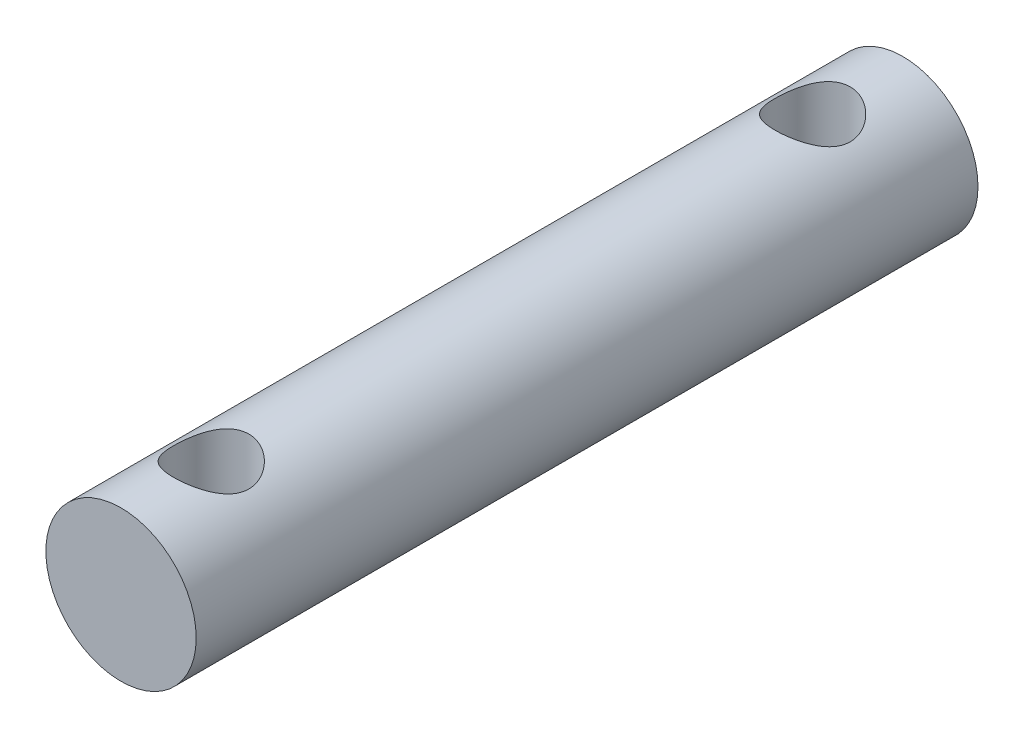
ISO-10303-21;
HEADER;
FILE_DESCRIPTION(('STEP AP214'),'2;1');
FILE_NAME('part.step','',(''),(''),'','','');
FILE_SCHEMA(('AUTOMOTIVE_DESIGN { 1 0 10303 214 1 1 1 1 }'));
ENDSEC;
DATA;
#1=APPLICATION_CONTEXT('core data for automotive mechanical design processes');
#2=APPLICATION_PROTOCOL_DEFINITION('international standard','automotive_design',2000,#1);
#3=PRODUCT_CONTEXT('',#1,'mechanical');
#4=PRODUCT('Part','Part','',(#3));
#5=PRODUCT_RELATED_PRODUCT_CATEGORY('part','',(#4));
#6=PRODUCT_DEFINITION_FORMATION('','',#4);
#7=PRODUCT_DEFINITION_CONTEXT('part definition',#1,'design');
#8=PRODUCT_DEFINITION('design','',#6,#7);
#9=PRODUCT_DEFINITION_SHAPE('','',#8);
#10=(LENGTH_UNIT() NAMED_UNIT(*) SI_UNIT(.MILLI.,.METRE.));
#11=(NAMED_UNIT(*) PLANE_ANGLE_UNIT() SI_UNIT($,.RADIAN.));
#12=(NAMED_UNIT(*) SI_UNIT($,.STERADIAN.) SOLID_ANGLE_UNIT());
#13=UNCERTAINTY_MEASURE_WITH_UNIT(LENGTH_MEASURE(1.E-05),#10,'distance_accuracy_value','');
#14=(GEOMETRIC_REPRESENTATION_CONTEXT(3) GLOBAL_UNCERTAINTY_ASSIGNED_CONTEXT((#13)) GLOBAL_UNIT_ASSIGNED_CONTEXT((#10,
#11,#12)) REPRESENTATION_CONTEXT('',''));
#15=CARTESIAN_POINT('',(0.,0.,0.));
#16=DIRECTION('',(0.,0.,1.));
#17=DIRECTION('',(1.,0.,0.));
#18=AXIS2_PLACEMENT_3D('',#15,#16,#17);
#19=CARTESIAN_POINT('',(0.772308089851625,0.,26.));
#20=DIRECTION('',(0.,0.,-1.));
#21=DIRECTION('',(-1.,0.,0.));
#22=AXIS2_PLACEMENT_3D('',#19,#20,#21);
#23=CYLINDRICAL_SURFACE('',#22,2.5);
#24=CARTESIAN_POINT('',(0.772308089851625,-2.5,4.25));
#25=CARTESIAN_POINT('',(0.838023043542859,-2.49999641755188,4.24999587210062));
#26=CARTESIAN_POINT('',(0.903816339474166,-2.49738113774397,4.24478740859791));
#27=CARTESIAN_POINT('',(1.03345838393716,-2.48717695046745,4.22418389957385));
#28=CARTESIAN_POINT('',(1.0973031982435,-2.47957859786229,4.20876950875294));
#29=CARTESIAN_POINT('',(1.22097502095234,-2.46020349254139,4.16850773922901));
#30=CARTESIAN_POINT('',(1.2808165935256,-2.448442989719,4.14369701968998));
#31=CARTESIAN_POINT('',(1.39539886085983,-2.42182220644723,4.08553672329382));
#32=CARTESIAN_POINT('',(1.45013995733919,-2.40696217041912,4.05218781968893));
#33=CARTESIAN_POINT('',(1.55669286205402,-2.37445322822571,3.97560343814338));
#34=CARTESIAN_POINT('',(1.60812710375427,-2.3566899890942,3.93189190095045));
#35=CARTESIAN_POINT('',(1.70328239593535,-2.3207496280843,3.83684815094121));
#36=CARTESIAN_POINT('',(1.74699756873508,-2.30257220261294,3.78551018528445));
#37=CARTESIAN_POINT('',(1.82887309041447,-2.26623688996684,3.67189581309577));
#38=CARTESIAN_POINT('',(1.86633975929117,-2.24818983712665,3.60907987706761));
#39=CARTESIAN_POINT('',(1.93001837346499,-2.21607473465401,3.47704083001723));
#40=CARTESIAN_POINT('',(1.95623835855954,-2.20200384508737,3.40782233909656));
#41=CARTESIAN_POINT('',(1.99497364258736,-2.1807233379726,3.2691686182226));
#42=CARTESIAN_POINT('',(2.00821541120218,-2.17315339479642,3.19999443491576));
#43=CARTESIAN_POINT('',(2.02284183148768,-2.16477362435659,3.06002645277565));
#44=CARTESIAN_POINT('',(2.02423820031797,-2.1639571167911,2.98923432391106));
#45=CARTESIAN_POINT('',(2.01566719881699,-2.1688866282156,2.85714246960579));
#46=CARTESIAN_POINT('',(2.00703878927265,-2.17385954577517,2.79571996097119));
#47=CARTESIAN_POINT('',(1.98098290117279,-2.18845285917313,2.6753476132837));
#48=CARTESIAN_POINT('',(1.96355261972369,-2.1980747353972,2.61639856836835));
#49=CARTESIAN_POINT('',(1.92007031533413,-2.22109345515926,2.50096358429292));
#50=CARTESIAN_POINT('',(1.89382692374662,-2.23457300829998,2.44456700151776));
#51=CARTESIAN_POINT('',(1.83361019943663,-2.26379255351754,2.33670713426249));
#52=CARTESIAN_POINT('',(1.79963339461721,-2.27953355975238,2.28524608049989));
#53=CARTESIAN_POINT('',(1.71989065849261,-2.31391447379107,2.18184843407097));
#54=CARTESIAN_POINT('',(1.67317616281323,-2.33266887795933,2.1306789080298));
#55=CARTESIAN_POINT('',(1.57175256327834,-2.36934529125509,2.03658072676137));
#56=CARTESIAN_POINT('',(1.51703966056948,-2.38726689948501,1.99365600995765));
#57=CARTESIAN_POINT('',(1.39795372214144,-2.42127484103705,1.91539292371284));
#58=CARTESIAN_POINT('',(1.33325007935089,-2.43723730202509,1.88049940944282));
#59=CARTESIAN_POINT('',(1.19789085921262,-2.46447351401553,1.82237871369624));
#60=CARTESIAN_POINT('',(1.12724006018322,-2.47575098679441,1.79914226873104));
#61=CARTESIAN_POINT('',(0.988266204427504,-2.49155417176795,1.76690574535415));
#62=CARTESIAN_POINT('',(0.920235003037032,-2.49656172876639,1.75688595531653));
#63=CARTESIAN_POINT('',(0.783282589788319,-2.50091266823877,1.74816908608189));
#64=CARTESIAN_POINT('',(0.71436181501425,-2.5002587340164,1.74946664295065));
#65=CARTESIAN_POINT('',(0.583266874869135,-2.49363990316801,1.76275836052344));
#66=CARTESIAN_POINT('',(0.520983829789184,-2.48809057110237,1.77391566591254));
#67=CARTESIAN_POINT('',(0.39929947447423,-2.47277714143524,1.80529758986886));
#68=CARTESIAN_POINT('',(0.33989848273788,-2.46301257917915,1.8255232080667));
#69=CARTESIAN_POINT('',(0.223697329289544,-2.43980314267087,1.87499808304146));
#70=CARTESIAN_POINT('',(0.167020093593934,-2.42626102212424,1.90448881264601));
#71=CARTESIAN_POINT('',(0.0592313877279745,-2.39679967896386,1.97138441955755));
#72=CARTESIAN_POINT('',(0.00812230263252321,-2.38087944457231,2.00879266824179));
#73=CARTESIAN_POINT('',(-0.092401521761691,-2.3463527667183,2.09470053166609));
#74=CARTESIAN_POINT('',(-0.141157007429173,-2.32763606060551,2.14392858556696));
#75=CARTESIAN_POINT('',(-0.230012311539924,-2.29077989504843,2.24990643908663));
#76=CARTESIAN_POINT('',(-0.270106142261926,-2.27264084226908,2.30666139852047));
#77=CARTESIAN_POINT('',(-0.342326803270494,-2.23813990282585,2.42955456775039));
#78=CARTESIAN_POINT('',(-0.373973779996671,-2.2219066207934,2.49601408276074));
#79=CARTESIAN_POINT('',(-0.425295442665628,-2.19467590460158,2.63438758461565));
#80=CARTESIAN_POINT('',(-0.444985555007837,-2.18367172800772,2.70629440812648));
#81=CARTESIAN_POINT('',(-0.470019019460473,-2.16951876260833,2.84613777857681));
#82=CARTESIAN_POINT('',(-0.476558155649456,-2.16571729325614,2.91379281678629));
#83=CARTESIAN_POINT('',(-0.478553353124358,-2.16456693307719,3.04930883396341));
#84=CARTESIAN_POINT('',(-0.474014218428873,-2.16721524534441,3.11716971092429));
#85=CARTESIAN_POINT('',(-0.455099567138704,-2.17797327562531,3.24435437691502));
#86=CARTESIAN_POINT('',(-0.441702303076875,-2.18553868102992,3.3038755876805));
#87=CARTESIAN_POINT('',(-0.406661107929182,-2.20463770234897,3.41976014928088));
#88=CARTESIAN_POINT('',(-0.385014524098138,-2.21617259462094,3.47612247761496));
#89=CARTESIAN_POINT('',(-0.332461591774229,-2.2428566295566,3.58828106373326));
#90=CARTESIAN_POINT('',(-0.301030832418948,-2.25819652995238,3.64378487728712));
#91=CARTESIAN_POINT('',(-0.230380624694168,-2.29044164543238,3.74909317022573));
#92=CARTESIAN_POINT('',(-0.191157124196686,-2.30734767243152,3.79889466314811));
#93=CARTESIAN_POINT('',(-0.100446068479177,-2.34327903949141,3.89767747794702));
#94=CARTESIAN_POINT('',(-0.0480474389110893,-2.36231229139336,3.9458238779524));
#95=CARTESIAN_POINT('',(0.0646145820762752,-2.39847190318859,4.03282872927954));
#96=CARTESIAN_POINT('',(0.124882185780643,-2.4155972326005,4.07168217428286));
#97=CARTESIAN_POINT('',(0.252393593826692,-2.44622511981379,4.13904545345275));
#98=CARTESIAN_POINT('',(0.319683709933357,-2.45970120703636,4.16748021176429));
#99=CARTESIAN_POINT('',(0.458880463233886,-2.48126676704332,4.21226020989869));
#100=CARTESIAN_POINT('',(0.530773340322668,-2.48937154216165,4.22863980853697));
#101=CARTESIAN_POINT('',(0.631555656747395,-2.49619327387079,4.24237176384481));
#102=CARTESIAN_POINT('',(0.659605740552251,-2.49761706674002,4.24522830107952));
#103=CARTESIAN_POINT('',(0.715868425092678,-2.49952121222331,4.24904333189601));
#104=CARTESIAN_POINT('',(0.744081030292398,-2.50000153879704,4.250001773089));
#105=CARTESIAN_POINT('',(0.772308089851625,-2.5,4.25));
#106=B_SPLINE_CURVE_WITH_KNOTS('',3,(#24,#25,#26,#27,#28,#29,#30,#31,#32,#33,#34,#35,#36,#37,
#38,#39,#40,#41,#42,#43,#44,#45,#46,#47,#48,#49,#50,#51,#52,#53,#54,#55,#56,#57,#58,#59,#60,#61,
#62,#63,#64,#65,#66,#67,#68,#69,#70,#71,#72,#73,#74,#75,#76,#77,#78,#79,#80,#81,#82,#83,#84,#85,
#86,#87,#88,#89,#90,#91,#92,#93,#94,#95,#96,#97,#98,#99,#100,#101,#102,#103,#104,#105),
.UNSPECIFIED.,.T.,.F.,(4,2,2,2,2,2,2,2,2,2,2,2,2,2,2,2,2,2,2,2,2,2,2,2,2,2,2,2,2,2,2,2,2,2,2,2,
2,2,2,2,4),(0.,0.197030321775366,0.394435187136497,0.591077694365373,0.787704700726959,
0.996227198397611,1.20490779706754,1.42977158038441,1.65447434872851,1.86572515175287,
2.07676696661276,2.26257140511651,2.44843504907098,2.63862800210609,2.82890651575277,
3.04331176667348,3.25781918248358,3.48228777768051,3.70657771140349,3.91229113089182,
4.11790705639345,4.30758633132652,4.49728652038664,4.69241070034873,4.88761813435424,
5.10199513305523,5.3165198576929,5.54143352699592,5.76605639925972,5.96911634372967,
6.17208824825007,6.35572412805228,6.53941910979597,6.73545570969518,6.93159451423697,
7.15156553440623,7.37165479220716,7.59330017078656,7.81431135781163,7.89894100172122,
7.98357298143558),.UNSPECIFIED.);
#107=CARTESIAN_POINT('',(0.772308089851625,-2.5,4.25));
#108=VERTEX_POINT('',#107);
#109=EDGE_CURVE('E10',#108,#108,#106,.T.);
#110=ORIENTED_EDGE('',*,*,#109,.T.);
#111=EDGE_LOOP('',(#110));
#112=FACE_BOUND('',#111,.T.);
#113=CARTESIAN_POINT('',(0.772308089851625,2.5,4.25));
#114=CARTESIAN_POINT('',(0.706593136160392,2.49999641755188,4.24999587210062));
#115=CARTESIAN_POINT('',(0.640799840229085,2.49738113774397,4.24478740859791));
#116=CARTESIAN_POINT('',(0.511157795766094,2.48717695046745,4.22418389957385));
#117=CARTESIAN_POINT('',(0.447312981459746,2.47957859786229,4.20876950875294));
#118=CARTESIAN_POINT('',(0.323641158750908,2.46020349254139,4.16850773922901));
#119=CARTESIAN_POINT('',(0.26379958617765,2.448442989719,4.14369701968998));
#120=CARTESIAN_POINT('',(0.149217318843419,2.42182220644723,4.08553672329382));
#121=CARTESIAN_POINT('',(0.0944762223640633,2.40696217041912,4.05218781968893));
#122=CARTESIAN_POINT('',(-0.012076682350773,2.37445322822571,3.97560343814338));
#123=CARTESIAN_POINT('',(-0.0635109240510138,2.3566899890942,3.93189190095045));
#124=CARTESIAN_POINT('',(-0.158666216232096,2.3207496280843,3.83684815094121));
#125=CARTESIAN_POINT('',(-0.202381389031832,2.30257220261294,3.78551018528445));
#126=CARTESIAN_POINT('',(-0.284256910711222,2.26623688996684,3.67189581309577));
#127=CARTESIAN_POINT('',(-0.321723579587921,2.24818983712665,3.60907987706761));
#128=CARTESIAN_POINT('',(-0.385402193761743,2.21607473465401,3.47704083001723));
#129=CARTESIAN_POINT('',(-0.411622178856292,2.20200384508737,3.40782233909656));
#130=CARTESIAN_POINT('',(-0.45035746288411,2.1807233379726,3.2691686182226));
#131=CARTESIAN_POINT('',(-0.463599231498926,2.17315339479642,3.19999443491576));
#132=CARTESIAN_POINT('',(-0.478225651784432,2.16477362435659,3.06002645277565));
#133=CARTESIAN_POINT('',(-0.479622020614717,2.1639571167911,2.98923432391106));
#134=CARTESIAN_POINT('',(-0.471051019113742,2.1688866282156,2.85714246960579));
#135=CARTESIAN_POINT('',(-0.462422609569402,2.17385954577517,2.79571996097119));
#136=CARTESIAN_POINT('',(-0.43636672146954,2.18845285917313,2.6753476132837));
#137=CARTESIAN_POINT('',(-0.418936440020439,2.1980747353972,2.61639856836835));
#138=CARTESIAN_POINT('',(-0.375454135630879,2.22109345515926,2.50096358429292));
#139=CARTESIAN_POINT('',(-0.349210744043368,2.23457300829998,2.44456700151776));
#140=CARTESIAN_POINT('',(-0.288994019733377,2.26379255351754,2.33670713426249));
#141=CARTESIAN_POINT('',(-0.255017214913959,2.27953355975238,2.28524608049989));
#142=CARTESIAN_POINT('',(-0.17527447878936,2.31391447379107,2.18184843407097));
#143=CARTESIAN_POINT('',(-0.128559983109976,2.33266887795933,2.1306789080298));
#144=CARTESIAN_POINT('',(-0.0271363835750912,2.36934529125509,2.03658072676137));
#145=CARTESIAN_POINT('',(0.0275765191337688,2.38726689948501,1.99365600995765));
#146=CARTESIAN_POINT('',(0.146662457561815,2.42127484103705,1.91539292371284));
#147=CARTESIAN_POINT('',(0.211366100352364,2.43723730202509,1.88049940944282));
#148=CARTESIAN_POINT('',(0.346725320490629,2.46447351401553,1.82237871369624));
#149=CARTESIAN_POINT('',(0.417376119520029,2.47575098679441,1.79914226873104));
#150=CARTESIAN_POINT('',(0.556349975275748,2.49155417176795,1.76690574535415));
#151=CARTESIAN_POINT('',(0.62438117666622,2.49656172876639,1.75688595531653));
#152=CARTESIAN_POINT('',(0.761333589914933,2.50091266823877,1.74816908608189));
#153=CARTESIAN_POINT('',(0.830254364689002,2.5002587340164,1.74946664295065));
#154=CARTESIAN_POINT('',(0.961349304834117,2.49363990316801,1.76275836052344));
#155=CARTESIAN_POINT('',(1.02363234991407,2.48809057110237,1.77391566591254));
#156=CARTESIAN_POINT('',(1.14531670522902,2.47277714143524,1.80529758986886));
#157=CARTESIAN_POINT('',(1.20471769696537,2.46301257917915,1.8255232080667));
#158=CARTESIAN_POINT('',(1.32091885041371,2.43980314267087,1.87499808304146));
#159=CARTESIAN_POINT('',(1.37759608610932,2.42626102212424,1.90448881264601));
#160=CARTESIAN_POINT('',(1.48538479197528,2.39679967896386,1.97138441955755));
#161=CARTESIAN_POINT('',(1.53649387707073,2.38087944457231,2.00879266824179));
#162=CARTESIAN_POINT('',(1.63701770146494,2.3463527667183,2.09470053166609));
#163=CARTESIAN_POINT('',(1.68577318713242,2.32763606060551,2.14392858556696));
#164=CARTESIAN_POINT('',(1.77462849124318,2.29077989504843,2.24990643908663));
#165=CARTESIAN_POINT('',(1.81472232196518,2.27264084226908,2.30666139852047));
#166=CARTESIAN_POINT('',(1.88694298297375,2.23813990282585,2.42955456775039));
#167=CARTESIAN_POINT('',(1.91858995969992,2.2219066207934,2.49601408276074));
#168=CARTESIAN_POINT('',(1.96991162236888,2.19467590460158,2.63438758461565));
#169=CARTESIAN_POINT('',(1.98960173471109,2.18367172800772,2.70629440812648));
#170=CARTESIAN_POINT('',(2.01463519916372,2.16951876260833,2.84613777857681));
#171=CARTESIAN_POINT('',(2.02117433535271,2.16571729325614,2.91379281678629));
#172=CARTESIAN_POINT('',(2.02316953282761,2.16456693307719,3.04930883396341));
#173=CARTESIAN_POINT('',(2.01863039813212,2.16721524534441,3.11716971092429));
#174=CARTESIAN_POINT('',(1.99971574684195,2.17797327562531,3.24435437691502));
#175=CARTESIAN_POINT('',(1.98631848278013,2.18553868102992,3.3038755876805));
#176=CARTESIAN_POINT('',(1.95127728763243,2.20463770234897,3.41976014928088));
#177=CARTESIAN_POINT('',(1.92963070380139,2.21617259462094,3.47612247761496));
#178=CARTESIAN_POINT('',(1.87707777147748,2.2428566295566,3.58828106373326));
#179=CARTESIAN_POINT('',(1.8456470121222,2.25819652995238,3.64378487728712));
#180=CARTESIAN_POINT('',(1.77499680439742,2.29044164543238,3.74909317022573));
#181=CARTESIAN_POINT('',(1.73577330389994,2.30734767243152,3.79889466314811));
#182=CARTESIAN_POINT('',(1.64506224818243,2.34327903949141,3.89767747794702));
#183=CARTESIAN_POINT('',(1.59266361861434,2.36231229139336,3.9458238779524));
#184=CARTESIAN_POINT('',(1.48000159762698,2.39847190318859,4.03282872927954));
#185=CARTESIAN_POINT('',(1.41973399392261,2.4155972326005,4.07168217428286));
#186=CARTESIAN_POINT('',(1.29222258587656,2.44622511981379,4.13904545345275));
#187=CARTESIAN_POINT('',(1.22493246976989,2.45970120703636,4.16748021176429));
#188=CARTESIAN_POINT('',(1.08573571646936,2.48126676704332,4.21226020989869));
#189=CARTESIAN_POINT('',(1.01384283938058,2.48937154216165,4.22863980853697));
#190=CARTESIAN_POINT('',(0.913060522955855,2.49619327387079,4.24237176384481));
#191=CARTESIAN_POINT('',(0.885010439150999,2.49761706674002,4.24522830107952));
#192=CARTESIAN_POINT('',(0.828747754610572,2.49952121222331,4.24904333189601));
#193=CARTESIAN_POINT('',(0.800535149410852,2.50000153879704,4.250001773089));
#194=CARTESIAN_POINT('',(0.772308089851625,2.5,4.25));
#195=B_SPLINE_CURVE_WITH_KNOTS('',3,(#113,#114,#115,#116,#117,#118,#119,#120,#121,#122,#123,
#124,#125,#126,#127,#128,#129,#130,#131,#132,#133,#134,#135,#136,#137,#138,#139,#140,#141,#142,
#143,#144,#145,#146,#147,#148,#149,#150,#151,#152,#153,#154,#155,#156,#157,#158,#159,#160,#161,
#162,#163,#164,#165,#166,#167,#168,#169,#170,#171,#172,#173,#174,#175,#176,#177,#178,#179,#180,
#181,#182,#183,#184,#185,#186,#187,#188,#189,#190,#191,#192,#193,#194),.UNSPECIFIED.,.T.,.F.,(4,
2,2,2,2,2,2,2,2,2,2,2,2,2,2,2,2,2,2,2,2,2,2,2,2,2,2,2,2,2,2,2,2,2,2,2,2,2,2,2,4),(0.,
0.197030321775366,0.394435187136497,0.591077694365373,0.787704700726959,0.996227198397611,
1.20490779706754,1.42977158038441,1.65447434872851,1.86572515175287,2.07676696661276,
2.26257140511651,2.44843504907098,2.63862800210609,2.82890651575277,3.04331176667348,
3.25781918248358,3.48228777768051,3.70657771140349,3.91229113089182,4.11790705639345,
4.30758633132652,4.49728652038664,4.69241070034873,4.88761813435424,5.10199513305524,
5.3165198576929,5.54143352699593,5.76605639925972,5.96911634372967,6.17208824825007,
6.35572412805228,6.53941910979598,6.73545570969518,6.93159451423697,7.15156553440623,
7.37165479220716,7.59330017078656,7.81431135781163,7.89894100172122,7.98357298143559),.UNSPECIFIED.);
#196=CARTESIAN_POINT('',(0.772308089851625,2.5,4.25));
#197=VERTEX_POINT('',#196);
#198=EDGE_CURVE('E55',#197,#197,#195,.T.);
#199=ORIENTED_EDGE('',*,*,#198,.T.);
#200=EDGE_LOOP('',(#199));
#201=FACE_BOUND('',#200,.T.);
#202=CARTESIAN_POINT('',(0.772308089851625,-2.5,24.25));
#203=CARTESIAN_POINT('',(0.838023043542859,-2.49999641755188,24.2499958721006));
#204=CARTESIAN_POINT('',(0.903816339474166,-2.49738113774397,24.2447874085979));
#205=CARTESIAN_POINT('',(1.03345838393716,-2.48717695046745,24.2241838995739));
#206=CARTESIAN_POINT('',(1.0973031982435,-2.47957859786229,24.2087695087529));
#207=CARTESIAN_POINT('',(1.22097502095234,-2.46020349254139,24.168507739229));
#208=CARTESIAN_POINT('',(1.2808165935256,-2.448442989719,24.14369701969));
#209=CARTESIAN_POINT('',(1.39539886085983,-2.42182220644723,24.0855367232938));
#210=CARTESIAN_POINT('',(1.45013995733919,-2.40696217041912,24.0521878196889));
#211=CARTESIAN_POINT('',(1.55669286205402,-2.37445322822571,23.9756034381434));
#212=CARTESIAN_POINT('',(1.60812710375427,-2.3566899890942,23.9318919009504));
#213=CARTESIAN_POINT('',(1.70328239593535,-2.3207496280843,23.8368481509412));
#214=CARTESIAN_POINT('',(1.74699756873508,-2.30257220261294,23.7855101852845));
#215=CARTESIAN_POINT('',(1.82887309041447,-2.26623688996684,23.6718958130958));
#216=CARTESIAN_POINT('',(1.86633975929117,-2.24818983712665,23.6090798770676));
#217=CARTESIAN_POINT('',(1.93001837346499,-2.21607473465401,23.4770408300172));
#218=CARTESIAN_POINT('',(1.95623835855954,-2.20200384508737,23.4078223390966));
#219=CARTESIAN_POINT('',(1.99497364258736,-2.1807233379726,23.2691686182226));
#220=CARTESIAN_POINT('',(2.00821541120218,-2.17315339479642,23.1999944349158));
#221=CARTESIAN_POINT('',(2.02284183148768,-2.16477362435659,23.0600264527757));
#222=CARTESIAN_POINT('',(2.02423820031797,-2.1639571167911,22.9892343239111));
#223=CARTESIAN_POINT('',(2.01566719881699,-2.1688866282156,22.8571424696058));
#224=CARTESIAN_POINT('',(2.00703878927265,-2.17385954577517,22.7957199609712));
#225=CARTESIAN_POINT('',(1.98098290117279,-2.18845285917313,22.6753476132837));
#226=CARTESIAN_POINT('',(1.96355261972369,-2.1980747353972,22.6163985683684));
#227=CARTESIAN_POINT('',(1.92007031533413,-2.22109345515926,22.5009635842929));
#228=CARTESIAN_POINT('',(1.89382692374662,-2.23457300829998,22.4445670015178));
#229=CARTESIAN_POINT('',(1.83361019943663,-2.26379255351754,22.3367071342625));
#230=CARTESIAN_POINT('',(1.79963339461721,-2.27953355975238,22.2852460804999));
#231=CARTESIAN_POINT('',(1.71989065849261,-2.31391447379107,22.181848434071));
#232=CARTESIAN_POINT('',(1.67317616281323,-2.33266887795933,22.1306789080298));
#233=CARTESIAN_POINT('',(1.57175256327834,-2.36934529125509,22.0365807267614));
#234=CARTESIAN_POINT('',(1.51703966056948,-2.38726689948501,21.9936560099576));
#235=CARTESIAN_POINT('',(1.39795372214143,-2.42127484103705,21.9153929237128));
#236=CARTESIAN_POINT('',(1.33325007935088,-2.43723730202509,21.8804994094428));
#237=CARTESIAN_POINT('',(1.19789085921262,-2.46447351401553,21.8223787136962));
#238=CARTESIAN_POINT('',(1.12724006018322,-2.47575098679441,21.799142268731));
#239=CARTESIAN_POINT('',(0.988266204427501,-2.49155417176795,21.7669057453542));
#240=CARTESIAN_POINT('',(0.920235003037029,-2.49656172876639,21.7568859553165));
#241=CARTESIAN_POINT('',(0.783282589788316,-2.50091266823877,21.7481690860819));
#242=CARTESIAN_POINT('',(0.714361815014248,-2.5002587340164,21.7494666429507));
#243=CARTESIAN_POINT('',(0.583266874869132,-2.49363990316801,21.7627583605234));
#244=CARTESIAN_POINT('',(0.520983829789182,-2.48809057110237,21.7739156659125));
#245=CARTESIAN_POINT('',(0.399299474474229,-2.47277714143523,21.8052975898689));
#246=CARTESIAN_POINT('',(0.339898482737879,-2.46301257917915,21.8255232080667));
#247=CARTESIAN_POINT('',(0.223697329289544,-2.43980314267087,21.8749980830415));
#248=CARTESIAN_POINT('',(0.167020093593933,-2.42626102212424,21.904488812646));
#249=CARTESIAN_POINT('',(0.0592313877279741,-2.39679967896386,21.9713844195576));
#250=CARTESIAN_POINT('',(0.00812230263252249,-2.38087944457231,22.0087926682418));
#251=CARTESIAN_POINT('',(-0.0924015217616913,-2.3463527667183,22.0947005316661));
#252=CARTESIAN_POINT('',(-0.141157007429173,-2.32763606060551,22.143928585567));
#253=CARTESIAN_POINT('',(-0.230012311539924,-2.29077989504843,22.2499064390866));
#254=CARTESIAN_POINT('',(-0.270106142261926,-2.27264084226908,22.3066613985205));
#255=CARTESIAN_POINT('',(-0.342326803270495,-2.23813990282585,22.4295545677504));
#256=CARTESIAN_POINT('',(-0.373973779996672,-2.2219066207934,22.4960140827607));
#257=CARTESIAN_POINT('',(-0.425295442665629,-2.19467590460158,22.6343875846157));
#258=CARTESIAN_POINT('',(-0.444985555007838,-2.18367172800772,22.7062944081265));
#259=CARTESIAN_POINT('',(-0.470019019460474,-2.16951876260833,22.8461377785768));
#260=CARTESIAN_POINT('',(-0.476558155649456,-2.16571729325614,22.9137928167863));
#261=CARTESIAN_POINT('',(-0.478553353124359,-2.16456693307719,23.0493088339634));
#262=CARTESIAN_POINT('',(-0.474014218428873,-2.16721524534441,23.1171697109243));
#263=CARTESIAN_POINT('',(-0.455099567138703,-2.17797327562531,23.244354376915));
#264=CARTESIAN_POINT('',(-0.441702303076874,-2.18553868102992,23.3038755876805));
#265=CARTESIAN_POINT('',(-0.40666110792918,-2.20463770234897,23.4197601492809));
#266=CARTESIAN_POINT('',(-0.385014524098137,-2.21617259462094,23.476122477615));
#267=CARTESIAN_POINT('',(-0.332461591774228,-2.2428566295566,23.5882810637333));
#268=CARTESIAN_POINT('',(-0.301030832418947,-2.25819652995238,23.6437848772871));
#269=CARTESIAN_POINT('',(-0.230380624694168,-2.29044164543238,23.7490931702257));
#270=CARTESIAN_POINT('',(-0.191157124196685,-2.30734767243152,23.7988946631481));
#271=CARTESIAN_POINT('',(-0.100446068479175,-2.34327903949141,23.897677477947));
#272=CARTESIAN_POINT('',(-0.0480474389110873,-2.36231229139336,23.9458238779524));
#273=CARTESIAN_POINT('',(0.064614582076278,-2.3984719031886,24.0328287292795));
#274=CARTESIAN_POINT('',(0.124882185780647,-2.4155972326005,24.0716821742829));
#275=CARTESIAN_POINT('',(0.252393593826695,-2.44622511981379,24.1390454534528));
#276=CARTESIAN_POINT('',(0.31968370993336,-2.45970120703636,24.1674802117643));
#277=CARTESIAN_POINT('',(0.458880463233888,-2.48126676704332,24.2122602098987));
#278=CARTESIAN_POINT('',(0.530773340322669,-2.48937154216165,24.228639808537));
#279=CARTESIAN_POINT('',(0.631555656747396,-2.49619327387079,24.2423717638448));
#280=CARTESIAN_POINT('',(0.659605740552253,-2.49761706674002,24.2452283010795));
#281=CARTESIAN_POINT('',(0.715868425092679,-2.49952121222331,24.249043331896));
#282=CARTESIAN_POINT('',(0.744081030292399,-2.50000153879704,24.250001773089));
#283=CARTESIAN_POINT('',(0.772308089851625,-2.5,24.25));
#284=B_SPLINE_CURVE_WITH_KNOTS('',3,(#202,#203,#204,#205,#206,#207,#208,#209,#210,#211,#212,
#213,#214,#215,#216,#217,#218,#219,#220,#221,#222,#223,#224,#225,#226,#227,#228,#229,#230,#231,
#232,#233,#234,#235,#236,#237,#238,#239,#240,#241,#242,#243,#244,#245,#246,#247,#248,#249,#250,
#251,#252,#253,#254,#255,#256,#257,#258,#259,#260,#261,#262,#263,#264,#265,#266,#267,#268,#269,
#270,#271,#272,#273,#274,#275,#276,#277,#278,#279,#280,#281,#282,#283),.UNSPECIFIED.,.T.,.F.,(4,
2,2,2,2,2,2,2,2,2,2,2,2,2,2,2,2,2,2,2,2,2,2,2,2,2,2,2,2,2,2,2,2,2,2,2,2,2,2,2,4),(0.,
0.197030321775366,0.394435187136498,0.591077694365373,0.78770470072696,0.99622719839761,
1.20490779706754,1.42977158038441,1.65447434872851,1.86572515175287,2.07676696661276,
2.26257140511651,2.44843504907099,2.63862800210609,2.82890651575277,3.04331176667348,
3.25781918248358,3.48228777768051,3.7065777114035,3.91229113089182,4.11790705639345,
4.30758633132653,4.49728652038665,4.69241070034873,4.88761813435424,5.10199513305524,
5.3165198576929,5.54143352699593,5.76605639925973,5.96911634372967,6.17208824825007,
6.35572412805229,6.53941910979598,6.73545570969518,6.93159451423697,7.15156553440623,
7.37165479220716,7.59330017078657,7.81431135781163,7.89894100172122,7.98357298143559),.UNSPECIFIED.);
#285=CARTESIAN_POINT('',(0.772308089851625,-2.5,24.25));
#286=VERTEX_POINT('',#285);
#287=EDGE_CURVE('E60',#286,#286,#284,.T.);
#288=ORIENTED_EDGE('',*,*,#287,.T.);
#289=EDGE_LOOP('',(#288));
#290=FACE_BOUND('',#289,.T.);
#291=CARTESIAN_POINT('',(0.772308089851625,2.5,24.25));
#292=CARTESIAN_POINT('',(0.706593136160392,2.49999641755188,24.2499958721006));
#293=CARTESIAN_POINT('',(0.640799840229085,2.49738113774397,24.2447874085979));
#294=CARTESIAN_POINT('',(0.511157795766094,2.48717695046745,24.2241838995739));
#295=CARTESIAN_POINT('',(0.447312981459746,2.47957859786229,24.2087695087529));
#296=CARTESIAN_POINT('',(0.323641158750907,2.46020349254139,24.168507739229));
#297=CARTESIAN_POINT('',(0.26379958617765,2.448442989719,24.14369701969));
#298=CARTESIAN_POINT('',(0.149217318843419,2.42182220644723,24.0855367232938));
#299=CARTESIAN_POINT('',(0.0944762223640631,2.40696217041912,24.0521878196889));
#300=CARTESIAN_POINT('',(-0.0120766823507736,2.37445322822571,23.9756034381434));
#301=CARTESIAN_POINT('',(-0.0635109240510152,2.3566899890942,23.9318919009504));
#302=CARTESIAN_POINT('',(-0.158666216232097,2.3207496280843,23.8368481509412));
#303=CARTESIAN_POINT('',(-0.202381389031833,2.30257220261294,23.7855101852845));
#304=CARTESIAN_POINT('',(-0.284256910711222,2.26623688996684,23.6718958130958));
#305=CARTESIAN_POINT('',(-0.321723579587921,2.24818983712665,23.6090798770676));
#306=CARTESIAN_POINT('',(-0.385402193761744,2.21607473465401,23.4770408300172));
#307=CARTESIAN_POINT('',(-0.411622178856292,2.20200384508737,23.4078223390966));
#308=CARTESIAN_POINT('',(-0.450357462884111,2.1807233379726,23.2691686182226));
#309=CARTESIAN_POINT('',(-0.463599231498927,2.17315339479642,23.1999944349158));
#310=CARTESIAN_POINT('',(-0.478225651784433,2.16477362435659,23.0600264527757));
#311=CARTESIAN_POINT('',(-0.479622020614718,2.1639571167911,22.9892343239111));
#312=CARTESIAN_POINT('',(-0.471051019113743,2.1688866282156,22.8571424696058));
#313=CARTESIAN_POINT('',(-0.462422609569402,2.17385954577517,22.7957199609712));
#314=CARTESIAN_POINT('',(-0.43636672146954,2.18845285917313,22.6753476132837));
#315=CARTESIAN_POINT('',(-0.418936440020439,2.1980747353972,22.6163985683684));
#316=CARTESIAN_POINT('',(-0.375454135630879,2.22109345515926,22.5009635842929));
#317=CARTESIAN_POINT('',(-0.349210744043367,2.23457300829998,22.4445670015178));
#318=CARTESIAN_POINT('',(-0.288994019733377,2.26379255351754,22.3367071342625));
#319=CARTESIAN_POINT('',(-0.255017214913959,2.27953355975238,22.2852460804999));
#320=CARTESIAN_POINT('',(-0.17527447878936,2.31391447379107,22.181848434071));
#321=CARTESIAN_POINT('',(-0.128559983109976,2.33266887795933,22.1306789080298));
#322=CARTESIAN_POINT('',(-0.0271363835750909,2.36934529125509,22.0365807267614));
#323=CARTESIAN_POINT('',(0.0275765191337697,2.38726689948501,21.9936560099576));
#324=CARTESIAN_POINT('',(0.146662457561817,2.42127484103705,21.9153929237128));
#325=CARTESIAN_POINT('',(0.211366100352366,2.43723730202509,21.8804994094428));
#326=CARTESIAN_POINT('',(0.346725320490631,2.46447351401553,21.8223787136962));
#327=CARTESIAN_POINT('',(0.417376119520032,2.47575098679441,21.799142268731));
#328=CARTESIAN_POINT('',(0.55634997527575,2.49155417176795,21.7669057453542));
#329=CARTESIAN_POINT('',(0.624381176666222,2.49656172876639,21.7568859553165));
#330=CARTESIAN_POINT('',(0.761333589914935,2.50091266823877,21.7481690860819));
#331=CARTESIAN_POINT('',(0.830254364689003,2.5002587340164,21.7494666429507));
#332=CARTESIAN_POINT('',(0.961349304834119,2.49363990316801,21.7627583605234));
#333=CARTESIAN_POINT('',(1.02363234991407,2.48809057110237,21.7739156659125));
#334=CARTESIAN_POINT('',(1.14531670522902,2.47277714143523,21.8052975898689));
#335=CARTESIAN_POINT('',(1.20471769696537,2.46301257917915,21.8255232080667));
#336=CARTESIAN_POINT('',(1.32091885041371,2.43980314267087,21.8749980830415));
#337=CARTESIAN_POINT('',(1.37759608610932,2.42626102212424,21.904488812646));
#338=CARTESIAN_POINT('',(1.48538479197528,2.39679967896386,21.9713844195576));
#339=CARTESIAN_POINT('',(1.53649387707073,2.38087944457231,22.0087926682418));
#340=CARTESIAN_POINT('',(1.63701770146494,2.3463527667183,22.0947005316661));
#341=CARTESIAN_POINT('',(1.68577318713242,2.32763606060551,22.143928585567));
#342=CARTESIAN_POINT('',(1.77462849124318,2.29077989504843,22.2499064390866));
#343=CARTESIAN_POINT('',(1.81472232196518,2.27264084226908,22.3066613985205));
#344=CARTESIAN_POINT('',(1.88694298297375,2.23813990282585,22.4295545677504));
#345=CARTESIAN_POINT('',(1.91858995969992,2.2219066207934,22.4960140827607));
#346=CARTESIAN_POINT('',(1.96991162236888,2.19467590460158,22.6343875846157));
#347=CARTESIAN_POINT('',(1.98960173471109,2.18367172800772,22.7062944081265));
#348=CARTESIAN_POINT('',(2.01463519916372,2.16951876260833,22.8461377785768));
#349=CARTESIAN_POINT('',(2.02117433535271,2.16571729325614,22.9137928167863));
#350=CARTESIAN_POINT('',(2.02316953282761,2.16456693307719,23.0493088339634));
#351=CARTESIAN_POINT('',(2.01863039813212,2.16721524534441,23.1171697109243));
#352=CARTESIAN_POINT('',(1.99971574684195,2.17797327562531,23.244354376915));
#353=CARTESIAN_POINT('',(1.98631848278012,2.18553868102992,23.3038755876805));
#354=CARTESIAN_POINT('',(1.95127728763243,2.20463770234897,23.4197601492809));
#355=CARTESIAN_POINT('',(1.92963070380139,2.21617259462094,23.476122477615));
#356=CARTESIAN_POINT('',(1.87707777147748,2.2428566295566,23.5882810637333));
#357=CARTESIAN_POINT('',(1.8456470121222,2.25819652995238,23.6437848772871));
#358=CARTESIAN_POINT('',(1.77499680439742,2.29044164543238,23.7490931702257));
#359=CARTESIAN_POINT('',(1.73577330389994,2.30734767243152,23.7988946631481));
#360=CARTESIAN_POINT('',(1.64506224818243,2.34327903949141,23.897677477947));
#361=CARTESIAN_POINT('',(1.59266361861434,2.36231229139336,23.9458238779524));
#362=CARTESIAN_POINT('',(1.48000159762697,2.3984719031886,24.0328287292795));
#363=CARTESIAN_POINT('',(1.4197339939226,2.4155972326005,24.0716821742829));
#364=CARTESIAN_POINT('',(1.29222258587656,2.44622511981379,24.1390454534528));
#365=CARTESIAN_POINT('',(1.22493246976989,2.45970120703636,24.1674802117643));
#366=CARTESIAN_POINT('',(1.08573571646936,2.48126676704332,24.2122602098987));
#367=CARTESIAN_POINT('',(1.01384283938058,2.48937154216165,24.228639808537));
#368=CARTESIAN_POINT('',(0.913060522955855,2.49619327387079,24.2423717638448));
#369=CARTESIAN_POINT('',(0.885010439150998,2.49761706674002,24.2452283010795));
#370=CARTESIAN_POINT('',(0.828747754610572,2.49952121222331,24.249043331896));
#371=CARTESIAN_POINT('',(0.800535149410852,2.50000153879704,24.250001773089));
#372=CARTESIAN_POINT('',(0.772308089851625,2.5,24.25));
#373=B_SPLINE_CURVE_WITH_KNOTS('',3,(#291,#292,#293,#294,#295,#296,#297,#298,#299,#300,#301,
#302,#303,#304,#305,#306,#307,#308,#309,#310,#311,#312,#313,#314,#315,#316,#317,#318,#319,#320,
#321,#322,#323,#324,#325,#326,#327,#328,#329,#330,#331,#332,#333,#334,#335,#336,#337,#338,#339,
#340,#341,#342,#343,#344,#345,#346,#347,#348,#349,#350,#351,#352,#353,#354,#355,#356,#357,#358,
#359,#360,#361,#362,#363,#364,#365,#366,#367,#368,#369,#370,#371,#372),.UNSPECIFIED.,.T.,.F.,(4,
2,2,2,2,2,2,2,2,2,2,2,2,2,2,2,2,2,2,2,2,2,2,2,2,2,2,2,2,2,2,2,2,2,2,2,2,2,2,2,4),(0.,
0.197030321775366,0.394435187136497,0.591077694365373,0.78770470072696,0.996227198397611,
1.20490779706754,1.42977158038441,1.65447434872851,1.86572515175287,2.07676696661276,
2.26257140511651,2.44843504907099,2.63862800210609,2.82890651575277,3.04331176667348,
3.25781918248358,3.48228777768051,3.7065777114035,3.91229113089182,4.11790705639345,
4.30758633132653,4.49728652038664,4.69241070034873,4.88761813435424,5.10199513305523,
5.3165198576929,5.54143352699593,5.76605639925973,5.96911634372967,6.17208824825007,
6.35572412805229,6.53941910979598,6.73545570969518,6.93159451423698,7.15156553440623,
7.37165479220717,7.59330017078657,7.81431135781163,7.89894100172122,7.98357298143559),.UNSPECIFIED.);
#374=CARTESIAN_POINT('',(0.772308089851625,2.5,24.25));
#375=VERTEX_POINT('',#374);
#376=EDGE_CURVE('E65',#375,#375,#373,.T.);
#377=ORIENTED_EDGE('',*,*,#376,.T.);
#378=EDGE_LOOP('',(#377));
#379=FACE_BOUND('',#378,.T.);
#380=CARTESIAN_POINT('',(0.772308089851625,0.,26.));
#381=DIRECTION('',(0.,0.,1.));
#382=DIRECTION('',(1.,0.,0.));
#383=AXIS2_PLACEMENT_3D('',#380,#381,#382);
#384=CIRCLE('',#383,2.5);
#385=CARTESIAN_POINT('',(3.27230808985162,0.,26.));
#386=VERTEX_POINT('',#385);
#387=EDGE_CURVE('E94',#386,#386,#384,.T.);
#388=ORIENTED_EDGE('',*,*,#387,.F.);
#389=EDGE_LOOP('',(#388));
#390=FACE_BOUND('',#389,.T.);
#391=CARTESIAN_POINT('',(0.772308089851625,0.,0.));
#392=DIRECTION('',(0.,0.,1.));
#393=DIRECTION('',(1.,0.,0.));
#394=AXIS2_PLACEMENT_3D('',#391,#392,#393);
#395=CIRCLE('',#394,2.5);
#396=CARTESIAN_POINT('',(3.27230808985162,0.,0.));
#397=VERTEX_POINT('',#396);
#398=EDGE_CURVE('E95',#397,#397,#395,.T.);
#399=ORIENTED_EDGE('',*,*,#398,.T.);
#400=EDGE_LOOP('',(#399));
#401=FACE_BOUND('',#400,.T.);
#402=ADVANCED_FACE('F43',(#112,#201,#290,#379,#390,#401),#23,.T.);
#403=CARTESIAN_POINT('',(0.772308089851625,0.,26.));
#404=DIRECTION('',(0.,0.,1.));
#405=DIRECTION('',(1.,0.,0.));
#406=AXIS2_PLACEMENT_3D('',#403,#404,#405);
#407=PLANE('',#406);
#408=ORIENTED_EDGE('',*,*,#387,.T.);
#409=EDGE_LOOP('',(#408));
#410=FACE_BOUND('',#409,.T.);
#411=ADVANCED_FACE('F86',(#410),#407,.T.);
#412=CARTESIAN_POINT('',(0.772308089851625,0.,0.));
#413=DIRECTION('',(0.,0.,1.));
#414=DIRECTION('',(1.,0.,0.));
#415=AXIS2_PLACEMENT_3D('',#412,#413,#414);
#416=PLANE('',#415);
#417=ORIENTED_EDGE('',*,*,#398,.F.);
#418=EDGE_LOOP('',(#417));
#419=FACE_BOUND('',#418,.T.);
#420=ADVANCED_FACE('F84',(#419),#416,.F.);
#421=CARTESIAN_POINT('',(0.772308089851625,-2.5,23.));
#422=DIRECTION('',(0.,1.,0.));
#423=DIRECTION('',(0.,0.,1.));
#424=AXIS2_PLACEMENT_3D('',#421,#422,#423);
#425=CYLINDRICAL_SURFACE('',#424,1.25);
#426=ORIENTED_EDGE('',*,*,#376,.F.);
#427=EDGE_LOOP('',(#426));
#428=FACE_BOUND('',#427,.T.);
#429=ORIENTED_EDGE('',*,*,#287,.F.);
#430=EDGE_LOOP('',(#429));
#431=FACE_BOUND('',#430,.T.);
#432=ADVANCED_FACE('F78',(#428,#431),#425,.F.);
#433=CARTESIAN_POINT('',(0.772308089851625,-2.5,3.));
#434=DIRECTION('',(0.,1.,0.));
#435=DIRECTION('',(0.,0.,1.));
#436=AXIS2_PLACEMENT_3D('',#433,#434,#435);
#437=CYLINDRICAL_SURFACE('',#436,1.25);
#438=ORIENTED_EDGE('',*,*,#198,.F.);
#439=EDGE_LOOP('',(#438));
#440=FACE_BOUND('',#439,.T.);
#441=ORIENTED_EDGE('',*,*,#109,.F.);
#442=EDGE_LOOP('',(#441));
#443=FACE_BOUND('',#442,.T.);
#444=ADVANCED_FACE('F75',(#440,#443),#437,.F.);
#445=CLOSED_SHELL('',(#402,#411,#420,#432,#444));
#446=MANIFOLD_SOLID_BREP('B2',#445);
#447=ADVANCED_BREP_SHAPE_REPRESENTATION('',(#18,#446),#14);
#448=SHAPE_DEFINITION_REPRESENTATION(#9,#447);
ENDSEC;
END-ISO-10303-21;
